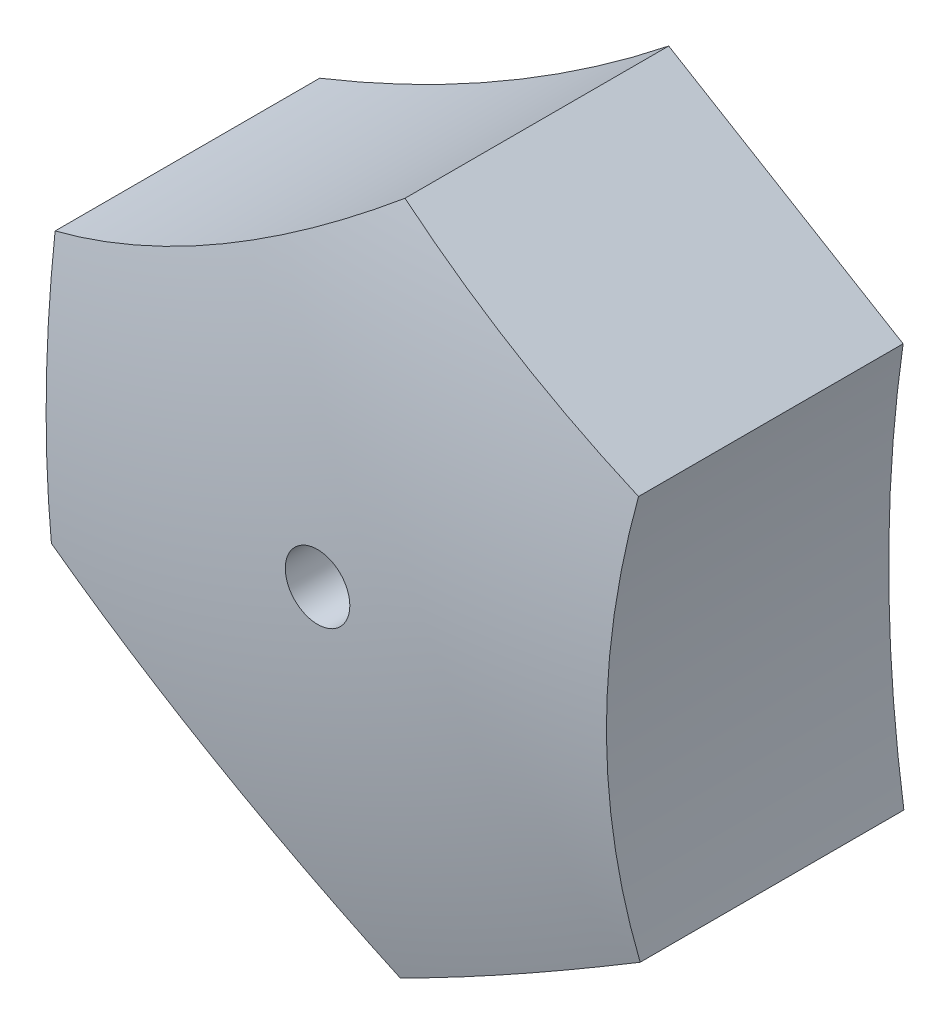
ISO-10303-21;
HEADER;
FILE_DESCRIPTION(('STEP AP214'),'2;1');
FILE_NAME('part.step','',(''),(''),'','','');
FILE_SCHEMA(('AUTOMOTIVE_DESIGN { 1 0 10303 214 1 1 1 1 }'));
ENDSEC;
DATA;
#1=APPLICATION_CONTEXT('core data for automotive mechanical design processes');
#2=APPLICATION_PROTOCOL_DEFINITION('international standard','automotive_design',2000,#1);
#3=PRODUCT_CONTEXT('',#1,'mechanical');
#4=PRODUCT('Part','Part','',(#3));
#5=PRODUCT_RELATED_PRODUCT_CATEGORY('part','',(#4));
#6=PRODUCT_DEFINITION_FORMATION('','',#4);
#7=PRODUCT_DEFINITION_CONTEXT('part definition',#1,'design');
#8=PRODUCT_DEFINITION('design','',#6,#7);
#9=PRODUCT_DEFINITION_SHAPE('','',#8);
#10=(LENGTH_UNIT() NAMED_UNIT(*) SI_UNIT(.MILLI.,.METRE.));
#11=(NAMED_UNIT(*) PLANE_ANGLE_UNIT() SI_UNIT($,.RADIAN.));
#12=(NAMED_UNIT(*) SI_UNIT($,.STERADIAN.) SOLID_ANGLE_UNIT());
#13=UNCERTAINTY_MEASURE_WITH_UNIT(LENGTH_MEASURE(1.E-05),#10,'distance_accuracy_value','');
#14=(GEOMETRIC_REPRESENTATION_CONTEXT(3) GLOBAL_UNCERTAINTY_ASSIGNED_CONTEXT((#13)) GLOBAL_UNIT_ASSIGNED_CONTEXT((#10,
#11,#12)) REPRESENTATION_CONTEXT('',''));
#15=CARTESIAN_POINT('',(0.,0.,0.));
#16=DIRECTION('',(0.,0.,1.));
#17=DIRECTION('',(1.,0.,0.));
#18=AXIS2_PLACEMENT_3D('',#15,#16,#17);
#19=CARTESIAN_POINT('',(27.0443965352272,-108.799794040306,13.751));
#20=DIRECTION('',(0.,0.,-1.));
#21=DIRECTION('',(-1.,0.,0.));
#22=AXIS2_PLACEMENT_3D('',#19,#20,#21);
#23=CYLINDRICAL_SURFACE('',#22,61.9822496754459);
#24=CARTESIAN_POINT('',(-34.2590168944264,-117.948060362527,11.8098026828428));
#25=CARTESIAN_POINT('',(-34.3406667864727,-117.401001236057,11.9106481176942));
#26=CARTESIAN_POINT('',(-34.4152124908946,-116.851216436684,12.0024742342504));
#27=CARTESIAN_POINT('',(-34.5497811052176,-115.747127802608,12.1679146208342));
#28=CARTESIAN_POINT('',(-34.6098034797822,-115.192823802103,12.2415282195425));
#29=CARTESIAN_POINT('',(-34.7150301400593,-114.080403239398,12.3703937501408));
#30=CARTESIAN_POINT('',(-34.7602273157435,-113.522284978516,12.425636871895));
#31=CARTESIAN_POINT('',(-34.8355405267502,-112.403556225924,12.5175869067944));
#32=CARTESIAN_POINT('',(-34.8656569213404,-111.842945793905,12.5542942615152));
#33=CARTESIAN_POINT('',(-34.9322700384546,-110.180281169299,12.6354227997373));
#34=CARTESIAN_POINT('',(-34.9470616308772,-109.075879695028,12.6533282852065));
#35=CARTESIAN_POINT('',(-34.9176090798183,-106.869647795457,12.6172369725644));
#36=CARTESIAN_POINT('',(-34.8733993020685,-105.767816247632,12.5632820300637));
#37=CARTESIAN_POINT('',(-34.7733982227363,-104.269698430326,12.440928592464));
#38=CARTESIAN_POINT('',(-34.7427144436283,-103.868927524277,12.4033680249791));
#39=CARTESIAN_POINT('',(-34.6736678267958,-103.069105164195,12.3187546211346));
#40=CARTESIAN_POINT('',(-34.635306416909,-102.670053404521,12.2717035497468));
#41=CARTESIAN_POINT('',(-34.5506987385783,-101.871156911191,12.1677918595123));
#42=CARTESIAN_POINT('',(-34.5043983347102,-101.47132672126,12.1108638567126));
#43=CARTESIAN_POINT('',(-34.4042210405893,-100.674018220153,11.9874906875179));
#44=CARTESIAN_POINT('',(-34.3503428282257,-100.276540332023,11.9210438603228));
#45=CARTESIAN_POINT('',(-34.2927422585743,-99.8804510477281,11.8498770640918));
#46=B_SPLINE_CURVE_WITH_KNOTS('',3,(#24,#25,#26,#27,#28,#29,#30,#31,#32,#33,#34,#35,#36,#37,#38,
#39,#40,#41,#42,#43,#44,#45),.UNSPECIFIED.,.F.,.F.,(4,2,2,2,2,2,2,2,2,2,4),(0.,1.68658868056956,
3.37323952009954,5.06069808306164,6.74811644398657,10.0579136594084,13.3657839030518,
14.5767358002566,15.7874627011237,17.0068000692197,18.2263504413236),.UNSPECIFIED.);
#47=CARTESIAN_POINT('',(-34.2590467399557,-117.947860362527,11.809839547943));
#48=VERTEX_POINT('',#47);
#49=CARTESIAN_POINT('',(-34.292771341251,-99.8806510477281,11.8499129974819));
#50=VERTEX_POINT('',#49);
#51=EDGE_CURVE('E41',#48,#50,#46,.T.);
#52=ORIENTED_EDGE('',*,*,#51,.F.);
#53=DIRECTION('',(0.,0.,-1.));
#54=VECTOR('',#53,1.);
#55=CARTESIAN_POINT('',(-34.2590467399557,-117.947860362527,13.751));
#56=LINE('',#55,#54);
#57=CARTESIAN_POINT('',(-34.2590467399557,-117.947860362527,0.));
#58=VERTEX_POINT('',#57);
#59=EDGE_CURVE('E107',#48,#58,#56,.T.);
#60=ORIENTED_EDGE('',*,*,#59,.T.);
#61=CARTESIAN_POINT('',(27.0443965352272,-108.799794040306,0.));
#62=DIRECTION('',(0.,0.,-1.));
#63=DIRECTION('',(-1.,0.,0.));
#64=AXIS2_PLACEMENT_3D('',#61,#62,#63);
#65=CIRCLE('',#64,61.9822496754459);
#66=CARTESIAN_POINT('',(-34.292771341251,-99.8806510477281,0.));
#67=VERTEX_POINT('',#66);
#68=EDGE_CURVE('E101',#58,#67,#65,.T.);
#69=ORIENTED_EDGE('',*,*,#68,.T.);
#70=DIRECTION('',(0.,0.,-1.));
#71=VECTOR('',#70,1.);
#72=CARTESIAN_POINT('',(-34.292771341251,-99.8806510477281,13.751));
#73=LINE('',#72,#71);
#74=EDGE_CURVE('E88',#50,#67,#73,.T.);
#75=ORIENTED_EDGE('',*,*,#74,.F.);
#76=EDGE_LOOP('',(#52,#60,#69,#75));
#77=FACE_BOUND('',#76,.T.);
#78=ADVANCED_FACE('F33',(#77),#23,.F.);
#79=CARTESIAN_POINT('',(-34.292771341251,-99.8806510477281,13.751));
#80=DIRECTION('',(-0.514504029883109,-0.8574879609849,0.));
#81=DIRECTION('',(0.8574879609849,-0.514504029883109,0.));
#82=AXIS2_PLACEMENT_3D('',#79,#80,#81);
#83=PLANE('',#82);
#84=CARTESIAN_POINT('',(-39.3745465353558,-96.8315192402985,-47.75));
#85=DIRECTION('',(-0.514504029883109,-0.8574879609849,0.));
#86=DIRECTION('',(0.8574879609849,-0.514504029883109,0.));
#87=AXIS2_PLACEMENT_3D('',#84,#85,#86);
#88=CIRCLE('',#87,59.8938333487673);
#89=CARTESIAN_POINT('',(-44.7907751616739,-93.5817109843224,11.8098395479433));
#90=VERTEX_POINT('',#89);
#91=EDGE_CURVE('E51',#50,#90,#88,.T.);
#92=ORIENTED_EDGE('',*,*,#91,.F.);
#93=ORIENTED_EDGE('',*,*,#74,.T.);
#94=DIRECTION('',(-0.8574879609849,0.514504029883109,0.));
#95=VECTOR('',#94,1.);
#96=CARTESIAN_POINT('',(-34.292771341251,-99.8806510477281,0.));
#97=LINE('',#96,#95);
#98=CARTESIAN_POINT('',(-44.7907751616739,-93.5817109843224,0.));
#99=VERTEX_POINT('',#98);
#100=EDGE_CURVE('E92',#67,#99,#97,.T.);
#101=ORIENTED_EDGE('',*,*,#100,.T.);
#102=DIRECTION('',(0.,0.,-1.));
#103=VECTOR('',#102,1.);
#104=CARTESIAN_POINT('',(-44.7907751616739,-93.5817109843224,13.751));
#105=LINE('',#104,#103);
#106=EDGE_CURVE('E96',#90,#99,#105,.T.);
#107=ORIENTED_EDGE('',*,*,#106,.F.);
#108=EDGE_LOOP('',(#92,#93,#101,#107));
#109=FACE_BOUND('',#108,.T.);
#110=ADVANCED_FACE('F90',(#109),#83,.F.);
#111=CARTESIAN_POINT('',(-83.3649546298129,-45.0654049296658,13.751));
#112=DIRECTION('',(0.,0.,-1.));
#113=DIRECTION('',(-1.,0.,0.));
#114=AXIS2_PLACEMENT_3D('',#111,#112,#113);
#115=CYLINDRICAL_SURFACE('',#114,61.9822496754459);
#116=CARTESIAN_POINT('',(-44.7905751616739,-93.5815519683304,11.8097929663377));
#117=CARTESIAN_POINT('',(-45.2235169785259,-93.9257927511484,11.9106389891722));
#118=CARTESIAN_POINT('',(-45.662371401773,-94.2652439755655,12.0024656956317));
#119=CARTESIAN_POINT('',(-46.5512552680771,-94.9338288557647,12.1679072646314));
#120=CARTESIAN_POINT('',(-47.0012851223936,-95.2629621308314,12.2415214558489));
#121=CARTESIAN_POINT('',(-47.9120556745465,-95.9103021409167,12.3703881729041));
#122=CARTESIAN_POINT('',(-48.3728013984875,-96.2285035678459,12.4256318886473));
#123=CARTESIAN_POINT('',(-49.3039917783293,-96.8530919056076,12.5175831114936));
#124=CARTESIAN_POINT('',(-49.7744362029009,-97.1594790977287,12.5542910601724));
#125=CARTESIAN_POINT('',(-51.1810386698091,-98.0485012689759,12.6354213516659));
#126=CARTESIAN_POINT('',(-52.1300821203163,-98.6135127230565,12.6533279998561));
#127=CARTESIAN_POINT('',(-54.055460411153,-99.6911237176949,12.617239006568));
#128=CARTESIAN_POINT('',(-55.031779040781,-100.203753580899,12.5632852204564));
#129=CARTESIAN_POINT('',(-56.3791921786892,-100.866212669065,12.4409329029169));
#130=CARTESIAN_POINT('',(-56.7416167178673,-101.040027845546,12.403372176234));
#131=CARTESIAN_POINT('',(-57.4688163123059,-101.380148010503,12.3187581925712));
#132=CARTESIAN_POINT('',(-57.8335909183245,-101.546454388388,12.2717067006177));
#133=CARTESIAN_POINT('',(-58.567769437629,-101.872634973938,12.1677938995003));
#134=CARTESIAN_POINT('',(-58.9371878240837,-102.032455024669,12.1108652033528));
#135=CARTESIAN_POINT('',(-59.677776102091,-102.344357543359,11.9874903846406));
#136=CARTESIAN_POINT('',(-60.0489462883385,-102.496438654772,11.9210426012264));
#137=CARTESIAN_POINT('',(-60.4207751031326,-102.644601699652,11.8498747188126));
#138=B_SPLINE_CURVE_WITH_KNOTS('',3,(#116,#117,#118,#119,#120,#121,#122,#123,#124,#125,#126,
#127,#128,#129,#130,#131,#132,#133,#134,#135,#136,#137),.UNSPECIFIED.,.F.,.F.,(4,2,2,2,2,2,2,2,
2,2,4),(0.,1.68658883861358,3.37323983650642,5.06069855417764,6.74811706980122,10.0579143498768,
13.365784669516,14.5767531343788,15.7874965990515,17.0068507988659,18.2264180060773),.UNSPECIFIED.);
#139=CARTESIAN_POINT('',(-60.4205751031327,-102.644522003176,11.849912997482));
#140=VERTEX_POINT('',#139);
#141=EDGE_CURVE('E140',#90,#140,#138,.T.);
#142=ORIENTED_EDGE('',*,*,#141,.F.);
#143=ORIENTED_EDGE('',*,*,#106,.T.);
#144=CARTESIAN_POINT('',(-83.3649546298129,-45.0654049296658,0.));
#145=DIRECTION('',(0.,0.,-1.));
#146=DIRECTION('',(-1.,0.,0.));
#147=AXIS2_PLACEMENT_3D('',#144,#145,#146);
#148=CIRCLE('',#147,61.9822496754459);
#149=CARTESIAN_POINT('',(-60.4205751031326,-102.644522003176,0.));
#150=VERTEX_POINT('',#149);
#151=EDGE_CURVE('E104',#99,#150,#148,.T.);
#152=ORIENTED_EDGE('',*,*,#151,.T.);
#153=DIRECTION('',(0.,0.,-1.));
#154=VECTOR('',#153,1.);
#155=CARTESIAN_POINT('',(-60.4205751031326,-102.644522003176,13.751));
#156=LINE('',#155,#154);
#157=EDGE_CURVE('E135',#140,#150,#156,.T.);
#158=ORIENTED_EDGE('',*,*,#157,.F.);
#159=EDGE_LOOP('',(#142,#143,#152,#158));
#160=FACE_BOUND('',#159,.T.);
#161=ADVANCED_FACE('F138',(#160),#115,.F.);
#162=CARTESIAN_POINT('',(-60.4205751031327,-102.644522003176,13.751));
#163=DIRECTION('',(0.999858372593797,-0.0168295797357899,0.));
#164=DIRECTION('',(0.0168295797357899,0.999858372593797,0.));
#165=AXIS2_PLACEMENT_3D('',#162,#163,#164);
#166=PLANE('',#165);
#167=CARTESIAN_POINT('',(-60.5203131108014,-108.570034321306,-47.75));
#168=DIRECTION('',(0.999858372593797,-0.0168295797357899,0.));
#169=DIRECTION('',(0.0168295797357899,0.999858372593797,0.));
#170=AXIS2_PLACEMENT_3D('',#167,#168,#169);
#171=CIRCLE('',#170,59.8938333487673);
#172=CARTESIAN_POINT('',(-60.6266153047461,-114.885530032391,11.8098395479432));
#173=VERTEX_POINT('',#172);
#174=EDGE_CURVE('E61',#140,#173,#171,.T.);
#175=ORIENTED_EDGE('',*,*,#174,.F.);
#176=ORIENTED_EDGE('',*,*,#157,.T.);
#177=DIRECTION('',(-0.0168295797357899,-0.999858372593797,0.));
#178=VECTOR('',#177,1.);
#179=CARTESIAN_POINT('',(-60.4205751031327,-102.644522003176,0.));
#180=LINE('',#179,#178);
#181=CARTESIAN_POINT('',(-60.6266153047461,-114.885530032391,0.));
#182=VERTEX_POINT('',#181);
#183=EDGE_CURVE('E122',#150,#182,#180,.T.);
#184=ORIENTED_EDGE('',*,*,#183,.T.);
#185=DIRECTION('',(0.,0.,-1.));
#186=VECTOR('',#185,1.);
#187=CARTESIAN_POINT('',(-60.6266153047461,-114.885530032391,13.751));
#188=LINE('',#187,#186);
#189=EDGE_CURVE('E133',#173,#182,#188,.T.);
#190=ORIENTED_EDGE('',*,*,#189,.F.);
#191=EDGE_LOOP('',(#175,#176,#184,#190));
#192=FACE_BOUND('',#191,.T.);
#193=ADVANCED_FACE('F195',(#192),#166,.F.);
#194=CARTESIAN_POINT('',(-83.3558791117897,-172.549902409268,13.751));
#195=DIRECTION('',(0.,0.,-1.));
#196=DIRECTION('',(-1.,0.,0.));
#197=AXIS2_PLACEMENT_3D('',#194,#195,#196);
#198=CYLINDRICAL_SURFACE('',#197,61.9822496754459);
#199=CARTESIAN_POINT('',(-60.6268153047461,-114.885451199839,11.8098003563766));
#200=CARTESIAN_POINT('',(-60.1122231932635,-115.088269785388,11.910645938826));
#201=CARTESIAN_POINT('',(-59.5988226700005,-115.298603616114,12.0024722022198));
#202=CARTESIAN_POINT('',(-58.5753694144063,-115.734107908283,12.1679128806264));
#203=CARTESIAN_POINT('',(-58.0653168061547,-115.959278916244,12.2415266243198));
#204=CARTESIAN_POINT('',(-57.0493188540515,-116.424360058075,12.3703924425193));
#205=CARTESIAN_POINT('',(-56.5433755940924,-116.664277198698,12.425635706958));
#206=CARTESIAN_POINT('',(-55.5368713028738,-117.158418251015,12.5175860248194));
#207=CARTESIAN_POINT('',(-55.0363101436754,-117.412641821729,12.5542935198169));
#208=CARTESIAN_POINT('',(-53.5630935860718,-118.186285210553,12.6354224657032));
#209=CARTESIAN_POINT('',(-52.5992579369467,-118.725675867643,12.653328219675));
#210=CARTESIAN_POINT('',(-50.7033310742285,-119.85429812314,12.6172374408931));
#211=CARTESIAN_POINT('',(-49.7712217057711,-120.443500521398,12.5632827634706));
#212=CARTESIAN_POINT('',(-48.5238094480745,-121.279165704132,12.4409292428841));
#213=CARTESIAN_POINT('',(-48.1920690674358,-121.506127125545,12.4033682018227));
#214=CARTESIAN_POINT('',(-47.5339170686025,-121.965840657578,12.3187535953202));
#215=CARTESIAN_POINT('',(-47.2075044717661,-122.19859168444,12.2717017949051));
#216=CARTESIAN_POINT('',(-46.5579350560422,-122.671318909704,12.1677883810189));
#217=CARTESIAN_POINT('',(-46.234817901883,-122.911334720608,12.1108593806314));
#218=CARTESIAN_POINT('',(-45.5944087897625,-123.396751969711,11.9874839600107));
#219=CARTESIAN_POINT('',(-45.2771178592578,-123.642154341394,11.9210358789287));
#220=CARTESIAN_POINT('',(-44.9628907619922,-123.890086129286,11.8498677023068));
#221=B_SPLINE_CURVE_WITH_KNOTS('',3,(#199,#200,#201,#202,#203,#204,#205,#206,#207,#208,#209,
#210,#211,#212,#213,#214,#215,#216,#217,#218,#219,#220),.UNSPECIFIED.,.F.,.F.,(4,2,2,2,2,2,2,2,
2,2,4),(0.,1.68658883233928,3.3732398236412,5.06069853206055,6.74811703851666,10.0579143092371,
13.3657846210959,14.5767528200663,15.7874960187907,17.0068499478434,18.2264168842981),.UNSPECIFIED.);
#222=CARTESIAN_POINT('',(-44.9630907619922,-123.889928328336,11.8499129974817));
#223=VERTEX_POINT('',#222);
#224=EDGE_CURVE('E66',#173,#223,#221,.T.);
#225=ORIENTED_EDGE('',*,*,#224,.F.);
#226=ORIENTED_EDGE('',*,*,#189,.T.);
#227=CARTESIAN_POINT('',(-83.3558791117897,-172.549902409268,0.));
#228=DIRECTION('',(0.,0.,-1.));
#229=DIRECTION('',(-1.,0.,0.));
#230=AXIS2_PLACEMENT_3D('',#227,#228,#229);
#231=CIRCLE('',#230,61.9822496754459);
#232=CARTESIAN_POINT('',(-44.9630907619922,-123.889928328336,0.));
#233=VERTEX_POINT('',#232);
#234=EDGE_CURVE('E125',#182,#233,#231,.T.);
#235=ORIENTED_EDGE('',*,*,#234,.T.);
#236=DIRECTION('',(0.,0.,-1.));
#237=VECTOR('',#236,1.);
#238=CARTESIAN_POINT('',(-44.9630907619922,-123.889928328336,13.751));
#239=LINE('',#238,#237);
#240=EDGE_CURVE('E131',#223,#233,#239,.T.);
#241=ORIENTED_EDGE('',*,*,#240,.F.);
#242=EDGE_LOOP('',(#225,#226,#235,#241));
#243=FACE_BOUND('',#242,.T.);
#244=ADVANCED_FACE('F199',(#243),#198,.F.);
#245=CARTESIAN_POINT('',(-44.9630907619922,-123.889928328336,13.751));
#246=DIRECTION('',(-0.485354342710688,0.874317540720691,0.));
#247=DIRECTION('',(-0.874317540720691,-0.485354342710688,0.));
#248=AXIS2_PLACEMENT_3D('',#245,#246,#247);
#249=PLANE('',#248);
#250=CARTESIAN_POINT('',(-39.7815775602191,-121.013547817635,-47.75));
#251=DIRECTION('',(-0.485354342710688,0.874317540720691,0.));
#252=DIRECTION('',(-0.874317540720691,-0.485354342710688,0.));
#253=AXIS2_PLACEMENT_3D('',#250,#251,#252);
#254=CIRCLE('',#253,59.8938333487671);
#255=EDGE_CURVE('E11',#223,#48,#254,.T.);
#256=ORIENTED_EDGE('',*,*,#255,.F.);
#257=ORIENTED_EDGE('',*,*,#240,.T.);
#258=DIRECTION('',(0.874317540720691,0.485354342710688,0.));
#259=VECTOR('',#258,1.);
#260=CARTESIAN_POINT('',(-44.9630907619922,-123.889928328336,0.));
#261=LINE('',#260,#259);
#262=EDGE_CURVE('E128',#233,#58,#261,.T.);
#263=ORIENTED_EDGE('',*,*,#262,.T.);
#264=ORIENTED_EDGE('',*,*,#59,.F.);
#265=EDGE_LOOP('',(#256,#257,#263,#264));
#266=FACE_BOUND('',#265,.T.);
#267=ADVANCED_FACE('F204',(#266),#249,.F.);
#268=CARTESIAN_POINT('',(27.0443965352272,-108.799794040306,0.));
#269=DIRECTION('',(0.,0.,-1.));
#270=DIRECTION('',(-1.,0.,0.));
#271=AXIS2_PLACEMENT_3D('',#268,#269,#270);
#272=PLANE('',#271);
#273=CARTESIAN_POINT('',(-46.7845281672908,-108.691568131374,0.));
#274=DIRECTION('',(0.,0.,-1.));
#275=DIRECTION('',(-1.,0.,0.));
#276=AXIS2_PLACEMENT_3D('',#273,#274,#275);
#277=CIRCLE('',#276,3.05);
#278=CARTESIAN_POINT('',(-49.8345281672908,-108.691568131374,0.));
#279=VERTEX_POINT('',#278);
#280=EDGE_CURVE('E112',#279,#279,#277,.T.);
#281=ORIENTED_EDGE('',*,*,#280,.F.);
#282=EDGE_LOOP('',(#281));
#283=FACE_BOUND('',#282,.T.);
#284=ORIENTED_EDGE('',*,*,#68,.F.);
#285=ORIENTED_EDGE('',*,*,#262,.F.);
#286=ORIENTED_EDGE('',*,*,#234,.F.);
#287=ORIENTED_EDGE('',*,*,#183,.F.);
#288=ORIENTED_EDGE('',*,*,#151,.F.);
#289=ORIENTED_EDGE('',*,*,#100,.F.);
#290=EDGE_LOOP('',(#284,#285,#286,#287,#288,#289));
#291=FACE_BOUND('',#290,.T.);
#292=ADVANCED_FACE('F99',(#283,#291),#272,.T.);
#293=CARTESIAN_POINT('',(-46.5588124021256,-108.805033793079,-47.75));
#294=DIRECTION('',(0.,1.,0.));
#295=DIRECTION('',(1.,0.,0.));
#296=AXIS2_PLACEMENT_3D('',#293,#294,#295);
#297=SPHERICAL_SURFACE('',#296,61.5);
#298=CARTESIAN_POINT('',(-47.5905761339434,-109.896884137845,13.7316503228918));
#299=CARTESIAN_POINT('',(-47.5228704867554,-109.942157544972,13.7319824416558));
#300=CARTESIAN_POINT('',(-47.4512921524987,-109.9817461806,13.7323182841227));
#301=CARTESIAN_POINT('',(-47.3024446306118,-110.048375586782,13.7329876986803));
#302=CARTESIAN_POINT('',(-47.2251686926834,-110.075401187113,13.7333212675492));
#303=CARTESIAN_POINT('',(-47.0672056780851,-110.116081746352,13.733976247949));
#304=CARTESIAN_POINT('',(-46.986520246756,-110.129743079377,13.7342976652051));
#305=CARTESIAN_POINT('',(-46.8240231222778,-110.143321212244,13.734919264929));
#306=CARTESIAN_POINT('',(-46.7422117139927,-110.143241426822,13.7352194526539));
#307=CARTESIAN_POINT('',(-46.5797542651531,-110.129349171307,13.735790203667));
#308=CARTESIAN_POINT('',(-46.4991083444813,-110.115535298577,13.7360607639263));
#309=CARTESIAN_POINT('',(-46.3412771826592,-110.074563531504,13.7365645523555));
#310=CARTESIAN_POINT('',(-46.2640920773989,-110.047405113682,13.7367977790604));
#311=CARTESIAN_POINT('',(-46.1153788980584,-109.980515955693,13.7372202632022));
#312=CARTESIAN_POINT('',(-46.0438506776299,-109.940785540906,13.7374095217769));
#313=CARTESIAN_POINT('',(-45.9084797552893,-109.849880027769,13.7377387053168));
#314=CARTESIAN_POINT('',(-45.8446370375669,-109.798704952964,13.7378786303836));
#315=CARTESIAN_POINT('',(-45.7264496770053,-109.68636313492,13.738105175625));
#316=CARTESIAN_POINT('',(-45.6721049753633,-109.625196453545,13.7381917961297));
#317=CARTESIAN_POINT('',(-45.5744559801325,-109.49460765716,13.7383092750538));
#318=CARTESIAN_POINT('',(-45.5311516662552,-109.425185557323,13.7383401335756));
#319=CARTESIAN_POINT('',(-45.4568128078018,-109.280056906732,13.7383452131389));
#320=CARTESIAN_POINT('',(-45.4257782016108,-109.204350387541,13.7383194344647));
#321=CARTESIAN_POINT('',(-45.3768593955854,-109.048801604631,13.738211971686));
#322=CARTESIAN_POINT('',(-45.3589752094974,-108.96895933659,13.7381302875231));
#323=CARTESIAN_POINT('',(-45.3368649568017,-108.807405676786,13.7379133320903));
#324=CARTESIAN_POINT('',(-45.3326388812683,-108.725694286244,13.7377780608554));
#325=CARTESIAN_POINT('',(-45.3379647442786,-108.562721896855,13.7374577703314));
#326=CARTESIAN_POINT('',(-45.3475166775165,-108.481460897835,13.7372727510615));
#327=CARTESIAN_POINT('',(-45.3801274294521,-108.321695578394,13.7368582144684));
#328=CARTESIAN_POINT('',(-45.4031863159467,-108.243191271813,13.7366286969218));
#329=CARTESIAN_POINT('',(-45.4621564096482,-108.091168217461,13.7361316782923));
#330=CARTESIAN_POINT('',(-45.4980676190627,-108.017649470545,13.7358641772028));
#331=CARTESIAN_POINT('',(-45.581723247145,-107.877683906079,13.7352987815641));
#332=CARTESIAN_POINT('',(-45.6294677594225,-107.811237144478,13.7350008867744));
#333=CARTESIAN_POINT('',(-45.7354344987096,-107.687302395555,13.7343831606253));
#334=CARTESIAN_POINT('',(-45.7936567257129,-107.629814408227,13.7340633292659));
#335=CARTESIAN_POINT('',(-45.9189266187759,-107.525428671028,13.7334108057128));
#336=CARTESIAN_POINT('',(-45.9859743513768,-107.478531001012,13.7330781134222));
#337=CARTESIAN_POINT('',(-46.1269916358545,-107.396657714368,13.7324093138787));
#338=CARTESIAN_POINT('',(-46.2009611882396,-107.361682098615,13.7320732066255));
#339=CARTESIAN_POINT('',(-46.3537226464366,-107.304645663073,13.7314071170486));
#340=CARTESIAN_POINT('',(-46.4325145708852,-107.282584893197,13.7310771347484));
#341=CARTESIAN_POINT('',(-46.5926838360093,-107.252004625247,13.7304326641565));
#342=CARTESIAN_POINT('',(-46.6740611763466,-107.2434851254,13.7301181758628));
#343=CARTESIAN_POINT('',(-46.837091071631,-107.240229278296,13.7295136222584));
#344=CARTESIAN_POINT('',(-46.9187436261075,-107.245492907486,13.729223556906));
#345=CARTESIAN_POINT('',(-47.0800062203683,-107.269653905171,13.7286760838891));
#346=CARTESIAN_POINT('',(-47.1596162593842,-107.288551278794,13.7284186762368));
#347=CARTESIAN_POINT('',(-47.3145333791014,-107.339443225129,13.7279438289475));
#348=CARTESIAN_POINT('',(-47.3898404854106,-107.371437719888,13.7277263890727));
#349=CARTESIAN_POINT('',(-47.5340143747497,-107.447615674643,13.7273376496943));
#350=CARTESIAN_POINT('',(-47.602881164865,-107.491799121229,13.72716635014));
#351=CARTESIAN_POINT('',(-47.7322189627074,-107.591100344744,13.7268747566197));
#352=CARTESIAN_POINT('',(-47.7926900426768,-107.646218027576,13.7267544622148));
#353=CARTESIAN_POINT('',(-47.9035205823451,-107.765823456969,13.7265682925282));
#354=CARTESIAN_POINT('',(-47.9538800242384,-107.830311220028,13.7265024173422));
#355=CARTESIAN_POINT('',(-48.0430571762864,-107.96682551536,13.7264269575002));
#356=CARTESIAN_POINT('',(-48.0818749843692,-108.038851983663,13.7264173723666));
#357=CARTESIAN_POINT('',(-48.1468675697208,-108.18839967682,13.7264547635507));
#358=CARTESIAN_POINT('',(-48.1730423218066,-108.265920912619,13.726501739981));
#359=CARTESIAN_POINT('',(-48.2120060320891,-108.42425867965,13.7266509216158));
#360=CARTESIAN_POINT('',(-48.2247947682832,-108.505075265512,13.7267531277361));
#361=CARTESIAN_POINT('',(-48.2366222717719,-108.667705228473,13.7270098626573));
#362=CARTESIAN_POINT('',(-48.2356615787445,-108.749518566324,13.7271643894043));
#363=CARTESIAN_POINT('',(-48.2200202549243,-108.911814080324,13.7275213576705));
#364=CARTESIAN_POINT('',(-48.2053410131294,-108.992296390401,13.7277237943374));
#365=CARTESIAN_POINT('',(-48.1626737192139,-109.149675748851,13.7281709112963));
#366=CARTESIAN_POINT('',(-48.1346823596445,-109.226571901012,13.728415602077));
#367=CARTESIAN_POINT('',(-48.0661758185218,-109.374603384343,13.7289403287296));
#368=CARTESIAN_POINT('',(-48.0256545714343,-109.445735904331,13.7292203816809));
#369=CARTESIAN_POINT('',(-47.9332694834789,-109.580121365217,13.729807583867));
#370=CARTESIAN_POINT('',(-47.8814193450045,-109.643383681369,13.7301147001031));
#371=CARTESIAN_POINT('',(-47.7892175296109,-109.738323246048,13.7306284210092));
#372=CARTESIAN_POINT('',(-47.7518479930503,-109.772947103855,13.7308295167924));
#373=CARTESIAN_POINT('',(-47.6736817697114,-109.838081977335,13.731236697986));
#374=CARTESIAN_POINT('',(-47.6328850829181,-109.868592992991,13.7314427833966));
#375=CARTESIAN_POINT('',(-47.5905761339434,-109.896884137845,13.7316503228918));
#376=B_SPLINE_CURVE_WITH_KNOTS('',3,(#298,#299,#300,#301,#302,#303,#304,#305,#306,#307,#308,
#309,#310,#311,#312,#313,#314,#315,#316,#317,#318,#319,#320,#321,#322,#323,#324,#325,#326,#327,
#328,#329,#330,#331,#332,#333,#334,#335,#336,#337,#338,#339,#340,#341,#342,#343,#344,#345,#346,
#347,#348,#349,#350,#351,#352,#353,#354,#355,#356,#357,#358,#359,#360,#361,#362,#363,#364,#365,
#366,#367,#368,#369,#370,#371,#372,#373,#374,#375),.UNSPECIFIED.,.T.,.F.,(4,2,2,2,2,2,2,2,2,2,2,
2,2,2,2,2,2,2,2,2,2,2,2,2,2,2,2,2,2,2,2,2,2,2,2,2,2,2,4),(0.,0.244159509874159,
0.488613088310447,0.732950017134732,0.97722622711211,1.22152738714213,1.46583813135742,
1.71014255298618,1.95444647203058,2.19874887851699,2.44305083605284,2.68735156676015,
2.93165255283947,3.17595337926588,3.42025411161405,3.6645560702217,3.90885807079394,
4.15316200403091,4.3974659371259,4.64177171229606,4.88607750540473,5.13038424272344,
5.37469094807465,5.6189972359827,5.86330361578373,6.10760854149737,6.35191319843319,
6.59621575307861,6.84051873791494,7.08481964983608,7.32912104836524,7.57342649848911,
7.81772235942125,8.06199348816791,8.30632533878291,8.55077565251137,8.79493192220728,
8.94750608151595,9.1000802414862),.UNSPECIFIED.);
#377=CARTESIAN_POINT('',(-47.5905761339434,-109.896884137845,13.7316503228918));
#378=VERTEX_POINT('',#377);
#379=EDGE_CURVE('E168',#378,#378,#376,.T.);
#380=ORIENTED_EDGE('',*,*,#379,.F.);
#381=EDGE_LOOP('',(#380));
#382=FACE_BOUND('',#381,.T.);
#383=ORIENTED_EDGE('',*,*,#51,.T.);
#384=ORIENTED_EDGE('',*,*,#91,.T.);
#385=ORIENTED_EDGE('',*,*,#141,.T.);
#386=ORIENTED_EDGE('',*,*,#174,.T.);
#387=ORIENTED_EDGE('',*,*,#224,.T.);
#388=ORIENTED_EDGE('',*,*,#255,.T.);
#389=EDGE_LOOP('',(#383,#384,#385,#386,#387,#388));
#390=FACE_BOUND('',#389,.T.);
#391=ADVANCED_FACE('F150',(#382,#390),#297,.T.);
#392=CARTESIAN_POINT('',(-46.7845281672908,-108.691568131374,4.));
#393=DIRECTION('',(0.,0.,-1.));
#394=DIRECTION('',(-1.,0.,0.));
#395=AXIS2_PLACEMENT_3D('',#392,#393,#394);
#396=CYLINDRICAL_SURFACE('',#395,3.05);
#397=CARTESIAN_POINT('',(-46.7845281672908,-108.691568131374,4.));
#398=DIRECTION('',(0.,0.,-1.));
#399=DIRECTION('',(-1.,0.,0.));
#400=AXIS2_PLACEMENT_3D('',#397,#398,#399);
#401=CIRCLE('',#400,3.05);
#402=CARTESIAN_POINT('',(-49.8345281672908,-108.691568131374,4.));
#403=VERTEX_POINT('',#402);
#404=EDGE_CURVE('E109',#403,#403,#401,.T.);
#405=ORIENTED_EDGE('',*,*,#404,.F.);
#406=EDGE_LOOP('',(#405));
#407=FACE_BOUND('',#406,.T.);
#408=ORIENTED_EDGE('',*,*,#280,.T.);
#409=EDGE_LOOP('',(#408));
#410=FACE_BOUND('',#409,.T.);
#411=ADVANCED_FACE('F155',(#407,#410),#396,.F.);
#412=CARTESIAN_POINT('',(-46.7845281672908,-108.691568131374,4.));
#413=DIRECTION('',(0.,0.,-1.));
#414=DIRECTION('',(-1.,0.,0.));
#415=AXIS2_PLACEMENT_3D('',#412,#413,#414);
#416=PLANE('',#415);
#417=CARTESIAN_POINT('',(-46.7845281672908,-108.691568131374,4.));
#418=DIRECTION('',(0.,0.,-1.));
#419=DIRECTION('',(-1.,0.,0.));
#420=AXIS2_PLACEMENT_3D('',#417,#418,#419);
#421=CIRCLE('',#420,1.45);
#422=CARTESIAN_POINT('',(-48.2345281672908,-108.691568131374,4.));
#423=VERTEX_POINT('',#422);
#424=EDGE_CURVE('E174',#423,#423,#421,.T.);
#425=ORIENTED_EDGE('',*,*,#424,.F.);
#426=EDGE_LOOP('',(#425));
#427=FACE_BOUND('',#426,.T.);
#428=ORIENTED_EDGE('',*,*,#404,.T.);
#429=EDGE_LOOP('',(#428));
#430=FACE_BOUND('',#429,.T.);
#431=ADVANCED_FACE('F178',(#427,#430),#416,.T.);
#432=CARTESIAN_POINT('',(-46.7845281672908,-108.691568131374,13.75));
#433=DIRECTION('',(0.,0.,-1.));
#434=DIRECTION('',(-1.,0.,0.));
#435=AXIS2_PLACEMENT_3D('',#432,#433,#434);
#436=CYLINDRICAL_SURFACE('',#435,1.45);
#437=ORIENTED_EDGE('',*,*,#379,.T.);
#438=EDGE_LOOP('',(#437));
#439=FACE_BOUND('',#438,.T.);
#440=ORIENTED_EDGE('',*,*,#424,.T.);
#441=EDGE_LOOP('',(#440));
#442=FACE_BOUND('',#441,.T.);
#443=ADVANCED_FACE('F175',(#439,#442),#436,.F.);
#444=CLOSED_SHELL('',(#78,#110,#161,#193,#244,#267,#292,#391,#411,#431,#443));
#445=MANIFOLD_SOLID_BREP('B2',#444);
#446=ADVANCED_BREP_SHAPE_REPRESENTATION('',(#18,#445),#14);
#447=SHAPE_DEFINITION_REPRESENTATION(#9,#446);
ENDSEC;
END-ISO-10303-21;
